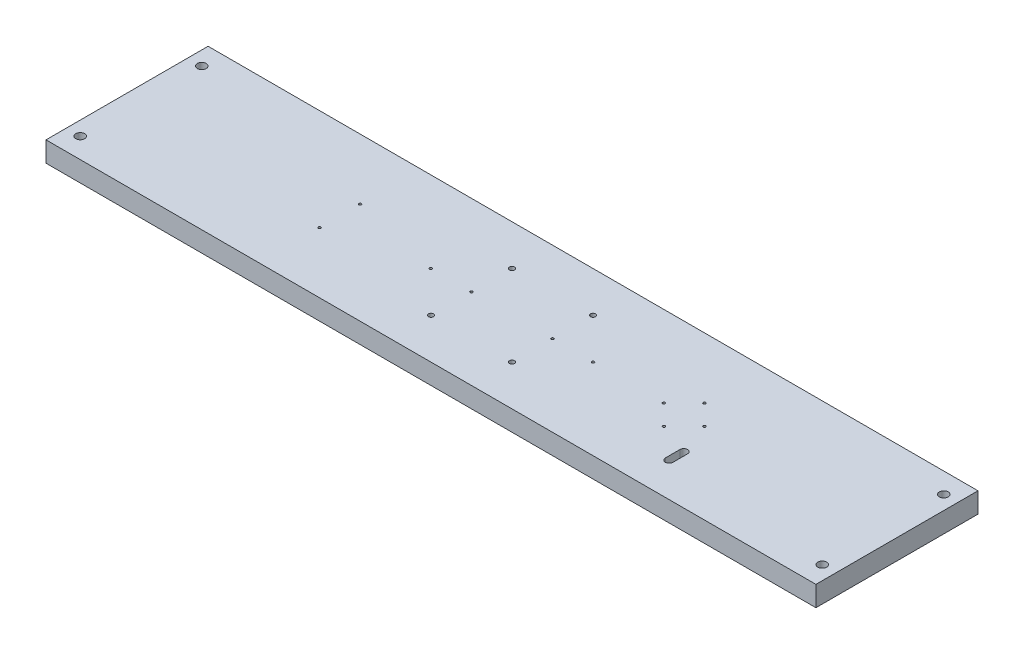
ISO-10303-21;
HEADER;
FILE_DESCRIPTION(('STEP AP214'),'2;1');
FILE_NAME('part.step','',(''),(''),'','','');
FILE_SCHEMA(('AUTOMOTIVE_DESIGN { 1 0 10303 214 1 1 1 1 }'));
ENDSEC;
DATA;
#1=APPLICATION_CONTEXT('core data for automotive mechanical design processes');
#2=APPLICATION_PROTOCOL_DEFINITION('international standard','automotive_design',2000,#1);
#3=PRODUCT_CONTEXT('',#1,'mechanical');
#4=PRODUCT('Part','Part','',(#3));
#5=PRODUCT_RELATED_PRODUCT_CATEGORY('part','',(#4));
#6=PRODUCT_DEFINITION_FORMATION('','',#4);
#7=PRODUCT_DEFINITION_CONTEXT('part definition',#1,'design');
#8=PRODUCT_DEFINITION('design','',#6,#7);
#9=PRODUCT_DEFINITION_SHAPE('','',#8);
#10=(LENGTH_UNIT() NAMED_UNIT(*) SI_UNIT(.MILLI.,.METRE.));
#11=(NAMED_UNIT(*) PLANE_ANGLE_UNIT() SI_UNIT($,.RADIAN.));
#12=(NAMED_UNIT(*) SI_UNIT($,.STERADIAN.) SOLID_ANGLE_UNIT());
#13=UNCERTAINTY_MEASURE_WITH_UNIT(LENGTH_MEASURE(1.E-05),#10,'distance_accuracy_value','');
#14=(GEOMETRIC_REPRESENTATION_CONTEXT(3) GLOBAL_UNCERTAINTY_ASSIGNED_CONTEXT((#13)) GLOBAL_UNIT_ASSIGNED_CONTEXT((#10,
#11,#12)) REPRESENTATION_CONTEXT('',''));
#15=CARTESIAN_POINT('',(0.,0.,0.));
#16=DIRECTION('',(0.,0.,1.));
#17=DIRECTION('',(1.,0.,0.));
#18=AXIS2_PLACEMENT_3D('',#15,#16,#17);
#19=CARTESIAN_POINT('',(241.3,12.7,50.8));
#20=DIRECTION('',(-1.,0.,0.));
#21=DIRECTION('',(0.,0.,1.));
#22=AXIS2_PLACEMENT_3D('',#19,#20,#21);
#23=PLANE('',#22);
#24=DIRECTION('',(0.,0.,-1.));
#25=VECTOR('',#24,1.);
#26=CARTESIAN_POINT('',(241.3,0.,50.8));
#27=LINE('',#26,#25);
#28=CARTESIAN_POINT('',(241.3,0.,50.8));
#29=VERTEX_POINT('',#28);
#30=CARTESIAN_POINT('',(241.3,0.,-50.8));
#31=VERTEX_POINT('',#30);
#32=EDGE_CURVE('E243',#29,#31,#27,.T.);
#33=ORIENTED_EDGE('',*,*,#32,.T.);
#34=DIRECTION('',(0.,-1.,0.));
#35=VECTOR('',#34,1.);
#36=CARTESIAN_POINT('',(241.3,12.7,-50.8));
#37=LINE('',#36,#35);
#38=CARTESIAN_POINT('',(241.3,12.7,-50.8));
#39=VERTEX_POINT('',#38);
#40=EDGE_CURVE('E11',#39,#31,#37,.T.);
#41=ORIENTED_EDGE('',*,*,#40,.F.);
#42=DIRECTION('',(0.,0.,-1.));
#43=VECTOR('',#42,1.);
#44=CARTESIAN_POINT('',(241.3,12.7,50.8));
#45=LINE('',#44,#43);
#46=CARTESIAN_POINT('',(241.3,12.7,50.8));
#47=VERTEX_POINT('',#46);
#48=EDGE_CURVE('E246',#47,#39,#45,.T.);
#49=ORIENTED_EDGE('',*,*,#48,.F.);
#50=DIRECTION('',(0.,-1.,0.));
#51=VECTOR('',#50,1.);
#52=CARTESIAN_POINT('',(241.3,12.7,50.8));
#53=LINE('',#52,#51);
#54=EDGE_CURVE('E256',#47,#29,#53,.T.);
#55=ORIENTED_EDGE('',*,*,#54,.T.);
#56=EDGE_LOOP('',(#33,#41,#49,#55));
#57=FACE_BOUND('',#56,.T.);
#58=ADVANCED_FACE('F37',(#57),#23,.F.);
#59=CARTESIAN_POINT('',(-241.3,12.7,-50.8));
#60=DIRECTION('',(0.,0.,1.));
#61=DIRECTION('',(1.,0.,0.));
#62=AXIS2_PLACEMENT_3D('',#59,#60,#61);
#63=PLANE('',#62);
#64=DIRECTION('',(-1.,0.,0.));
#65=VECTOR('',#64,1.);
#66=CARTESIAN_POINT('',(-241.3,0.,-50.8));
#67=LINE('',#66,#65);
#68=CARTESIAN_POINT('',(-241.3,0.,-50.8));
#69=VERTEX_POINT('',#68);
#70=EDGE_CURVE('E259',#31,#69,#67,.T.);
#71=ORIENTED_EDGE('',*,*,#70,.T.);
#72=DIRECTION('',(0.,-1.,0.));
#73=VECTOR('',#72,1.);
#74=CARTESIAN_POINT('',(-241.3,12.7,-50.8));
#75=LINE('',#74,#73);
#76=CARTESIAN_POINT('',(-241.3,12.7,-50.8));
#77=VERTEX_POINT('',#76);
#78=EDGE_CURVE('E44',#77,#69,#75,.T.);
#79=ORIENTED_EDGE('',*,*,#78,.F.);
#80=DIRECTION('',(-1.,0.,0.));
#81=VECTOR('',#80,1.);
#82=CARTESIAN_POINT('',(-241.3,12.7,-50.8));
#83=LINE('',#82,#81);
#84=EDGE_CURVE('E249',#39,#77,#83,.T.);
#85=ORIENTED_EDGE('',*,*,#84,.F.);
#86=ORIENTED_EDGE('',*,*,#40,.T.);
#87=EDGE_LOOP('',(#71,#79,#85,#86));
#88=FACE_BOUND('',#87,.T.);
#89=ADVANCED_FACE('F288',(#88),#63,.F.);
#90=CARTESIAN_POINT('',(-241.3,12.7,50.8));
#91=DIRECTION('',(1.,0.,0.));
#92=DIRECTION('',(0.,0.,-1.));
#93=AXIS2_PLACEMENT_3D('',#90,#91,#92);
#94=PLANE('',#93);
#95=DIRECTION('',(0.,0.,1.));
#96=VECTOR('',#95,1.);
#97=CARTESIAN_POINT('',(-241.3,0.,50.8));
#98=LINE('',#97,#96);
#99=CARTESIAN_POINT('',(-241.3,0.,50.8));
#100=VERTEX_POINT('',#99);
#101=EDGE_CURVE('E261',#69,#100,#98,.T.);
#102=ORIENTED_EDGE('',*,*,#101,.T.);
#103=DIRECTION('',(0.,-1.,0.));
#104=VECTOR('',#103,1.);
#105=CARTESIAN_POINT('',(-241.3,12.7,50.8));
#106=LINE('',#105,#104);
#107=CARTESIAN_POINT('',(-241.3,12.7,50.8));
#108=VERTEX_POINT('',#107);
#109=EDGE_CURVE('E266',#108,#100,#106,.T.);
#110=ORIENTED_EDGE('',*,*,#109,.F.);
#111=DIRECTION('',(0.,0.,1.));
#112=VECTOR('',#111,1.);
#113=CARTESIAN_POINT('',(-241.3,12.7,50.8));
#114=LINE('',#113,#112);
#115=EDGE_CURVE('E252',#77,#108,#114,.T.);
#116=ORIENTED_EDGE('',*,*,#115,.F.);
#117=ORIENTED_EDGE('',*,*,#78,.T.);
#118=EDGE_LOOP('',(#102,#110,#116,#117));
#119=FACE_BOUND('',#118,.T.);
#120=ADVANCED_FACE('F273',(#119),#94,.F.);
#121=CARTESIAN_POINT('',(-241.3,12.7,50.8));
#122=DIRECTION('',(0.,0.,-1.));
#123=DIRECTION('',(-1.,0.,0.));
#124=AXIS2_PLACEMENT_3D('',#121,#122,#123);
#125=PLANE('',#124);
#126=DIRECTION('',(1.,0.,0.));
#127=VECTOR('',#126,1.);
#128=CARTESIAN_POINT('',(-241.3,0.,50.8));
#129=LINE('',#128,#127);
#130=EDGE_CURVE('E250',#100,#29,#129,.T.);
#131=ORIENTED_EDGE('',*,*,#130,.T.);
#132=ORIENTED_EDGE('',*,*,#54,.F.);
#133=DIRECTION('',(1.,0.,0.));
#134=VECTOR('',#133,1.);
#135=CARTESIAN_POINT('',(-241.3,12.7,50.8));
#136=LINE('',#135,#134);
#137=EDGE_CURVE('E254',#108,#47,#136,.T.);
#138=ORIENTED_EDGE('',*,*,#137,.F.);
#139=ORIENTED_EDGE('',*,*,#109,.T.);
#140=EDGE_LOOP('',(#131,#132,#138,#139));
#141=FACE_BOUND('',#140,.T.);
#142=ADVANCED_FACE('F281',(#141),#125,.F.);
#143=CARTESIAN_POINT('',(0.,12.7,0.));
#144=DIRECTION('',(0.,-1.,0.));
#145=DIRECTION('',(0.,0.,-1.));
#146=AXIS2_PLACEMENT_3D('',#143,#144,#145);
#147=PLANE('',#146);
#148=DIRECTION('',(0.,0.,1.));
#149=VECTOR('',#148,1.);
#150=CARTESIAN_POINT('',(125.489928348176,12.7,20.1549));
#151=LINE('',#150,#149);
#152=CARTESIAN_POINT('',(125.489928348176,12.7,20.1549));
#153=VERTEX_POINT('',#152);
#154=CARTESIAN_POINT('',(125.489928348176,12.7,29.3751));
#155=VERTEX_POINT('',#154);
#156=EDGE_CURVE('E128',#153,#155,#151,.T.);
#157=ORIENTED_EDGE('',*,*,#156,.F.);
#158=CARTESIAN_POINT('',(127.864828348176,12.7,20.1549));
#159=DIRECTION('',(0.,1.,0.));
#160=DIRECTION('',(0.,0.,-1.));
#161=AXIS2_PLACEMENT_3D('',#158,#159,#160);
#162=CIRCLE('',#161,2.37490000000001);
#163=CARTESIAN_POINT('',(130.239728348176,12.7,20.1549));
#164=VERTEX_POINT('',#163);
#165=EDGE_CURVE('E51',#164,#153,#162,.T.);
#166=ORIENTED_EDGE('',*,*,#165,.F.);
#167=DIRECTION('',(0.,0.,-1.));
#168=VECTOR('',#167,1.);
#169=CARTESIAN_POINT('',(130.239728348176,12.7,20.1549));
#170=LINE('',#169,#168);
#171=CARTESIAN_POINT('',(130.239728348176,12.7,29.3751));
#172=VERTEX_POINT('',#171);
#173=EDGE_CURVE('E119',#172,#164,#170,.T.);
#174=ORIENTED_EDGE('',*,*,#173,.F.);
#175=CARTESIAN_POINT('',(127.864828348176,12.7,29.3751));
#176=DIRECTION('',(0.,1.,0.));
#177=DIRECTION('',(0.,0.,-1.));
#178=AXIS2_PLACEMENT_3D('',#175,#176,#177);
#179=CIRCLE('',#178,2.37489999999999);
#180=EDGE_CURVE('E122',#155,#172,#179,.T.);
#181=ORIENTED_EDGE('',*,*,#180,.F.);
#182=EDGE_LOOP('',(#157,#166,#174,#181));
#183=FACE_BOUND('',#182,.T.);
#184=CARTESIAN_POINT('',(95.25,12.7,0.));
#185=DIRECTION('',(0.,1.,0.));
#186=DIRECTION('',(0.,0.,1.));
#187=AXIS2_PLACEMENT_3D('',#184,#185,#186);
#188=CIRCLE('',#187,0.793749999999993);
#189=CARTESIAN_POINT('',(95.25,12.7,0.793749999999993));
#190=VERTEX_POINT('',#189);
#191=EDGE_CURVE('E142',#190,#190,#188,.T.);
#192=ORIENTED_EDGE('',*,*,#191,.F.);
#193=EDGE_LOOP('',(#192));
#194=FACE_BOUND('',#193,.T.);
#195=CARTESIAN_POINT('',(120.65,12.7,0.));
#196=DIRECTION('',(0.,1.,0.));
#197=DIRECTION('',(0.,0.,1.));
#198=AXIS2_PLACEMENT_3D('',#195,#196,#197);
#199=CIRCLE('',#198,0.793749999999993);
#200=CARTESIAN_POINT('',(120.65,12.7,0.793749999999993));
#201=VERTEX_POINT('',#200);
#202=EDGE_CURVE('E145',#201,#201,#199,.T.);
#203=ORIENTED_EDGE('',*,*,#202,.F.);
#204=EDGE_LOOP('',(#203));
#205=FACE_BOUND('',#204,.T.);
#206=CARTESIAN_POINT('',(-107.95,12.7,-12.7));
#207=DIRECTION('',(0.,1.,0.));
#208=DIRECTION('',(0.,0.,1.));
#209=AXIS2_PLACEMENT_3D('',#206,#207,#208);
#210=CIRCLE('',#209,0.793749999999993);
#211=CARTESIAN_POINT('',(-107.95,12.7,-11.90625));
#212=VERTEX_POINT('',#211);
#213=EDGE_CURVE('E175',#212,#212,#210,.T.);
#214=ORIENTED_EDGE('',*,*,#213,.F.);
#215=EDGE_LOOP('',(#214));
#216=FACE_BOUND('',#215,.T.);
#217=CARTESIAN_POINT('',(50.8,12.7,0.));
#218=DIRECTION('',(0.,1.,0.));
#219=DIRECTION('',(0.,0.,1.));
#220=AXIS2_PLACEMENT_3D('',#217,#218,#219);
#221=CIRCLE('',#220,0.79375);
#222=CARTESIAN_POINT('',(50.8,12.7,0.79375));
#223=VERTEX_POINT('',#222);
#224=EDGE_CURVE('E168',#223,#223,#221,.T.);
#225=ORIENTED_EDGE('',*,*,#224,.F.);
#226=EDGE_LOOP('',(#225));
#227=FACE_BOUND('',#226,.T.);
#228=CARTESIAN_POINT('',(-50.8,12.7,0.));
#229=DIRECTION('',(0.,1.,0.));
#230=DIRECTION('',(0.,0.,1.));
#231=AXIS2_PLACEMENT_3D('',#228,#229,#230);
#232=CIRCLE('',#231,0.79375);
#233=CARTESIAN_POINT('',(-50.8,12.7,0.79375));
#234=VERTEX_POINT('',#233);
#235=EDGE_CURVE('E187',#234,#234,#232,.T.);
#236=ORIENTED_EDGE('',*,*,#235,.F.);
#237=EDGE_LOOP('',(#236));
#238=FACE_BOUND('',#237,.T.);
#239=CARTESIAN_POINT('',(25.4,12.7,0.));
#240=DIRECTION('',(0.,1.,0.));
#241=DIRECTION('',(0.,0.,1.));
#242=AXIS2_PLACEMENT_3D('',#239,#240,#241);
#243=CIRCLE('',#242,0.793749999999999);
#244=CARTESIAN_POINT('',(25.4,12.7,0.793749999999999));
#245=VERTEX_POINT('',#244);
#246=EDGE_CURVE('E180',#245,#245,#243,.T.);
#247=ORIENTED_EDGE('',*,*,#246,.F.);
#248=EDGE_LOOP('',(#247));
#249=FACE_BOUND('',#248,.T.);
#250=CARTESIAN_POINT('',(-107.95,12.7,12.7));
#251=DIRECTION('',(0.,1.,0.));
#252=DIRECTION('',(0.,0.,1.));
#253=AXIS2_PLACEMENT_3D('',#250,#251,#252);
#254=CIRCLE('',#253,0.793749999999993);
#255=CARTESIAN_POINT('',(-107.95,12.7,13.49375));
#256=VERTEX_POINT('',#255);
#257=EDGE_CURVE('E150',#256,#256,#254,.T.);
#258=ORIENTED_EDGE('',*,*,#257,.F.);
#259=EDGE_LOOP('',(#258));
#260=FACE_BOUND('',#259,.T.);
#261=CARTESIAN_POINT('',(107.95,12.7,12.7));
#262=DIRECTION('',(0.,1.,0.));
#263=DIRECTION('',(0.,0.,1.));
#264=AXIS2_PLACEMENT_3D('',#261,#262,#263);
#265=CIRCLE('',#264,0.793749999999993);
#266=CARTESIAN_POINT('',(107.95,12.7,13.49375));
#267=VERTEX_POINT('',#266);
#268=EDGE_CURVE('E157',#267,#267,#265,.T.);
#269=ORIENTED_EDGE('',*,*,#268,.F.);
#270=EDGE_LOOP('',(#269));
#271=FACE_BOUND('',#270,.T.);
#272=CARTESIAN_POINT('',(107.95,12.7,-12.7));
#273=DIRECTION('',(0.,1.,0.));
#274=DIRECTION('',(0.,0.,1.));
#275=AXIS2_PLACEMENT_3D('',#272,#273,#274);
#276=CIRCLE('',#275,0.793749999999993);
#277=CARTESIAN_POINT('',(107.95,12.7,-11.90625));
#278=VERTEX_POINT('',#277);
#279=EDGE_CURVE('E163',#278,#278,#276,.T.);
#280=ORIENTED_EDGE('',*,*,#279,.F.);
#281=EDGE_LOOP('',(#280));
#282=FACE_BOUND('',#281,.T.);
#283=CARTESIAN_POINT('',(-25.4,12.7,0.));
#284=DIRECTION('',(0.,1.,0.));
#285=DIRECTION('',(0.,0.,1.));
#286=AXIS2_PLACEMENT_3D('',#283,#284,#285);
#287=CIRCLE('',#286,0.793749999999999);
#288=CARTESIAN_POINT('',(-25.4,12.7,0.793749999999999));
#289=VERTEX_POINT('',#288);
#290=EDGE_CURVE('E183',#289,#289,#287,.T.);
#291=ORIENTED_EDGE('',*,*,#290,.F.);
#292=EDGE_LOOP('',(#291));
#293=FACE_BOUND('',#292,.T.);
#294=CARTESIAN_POINT('',(-25.4,12.7,25.4));
#295=DIRECTION('',(0.,1.,0.));
#296=DIRECTION('',(0.,0.,1.));
#297=AXIS2_PLACEMENT_3D('',#294,#295,#296);
#298=CIRCLE('',#297,1.5875);
#299=CARTESIAN_POINT('',(-25.4,12.7,26.9875));
#300=VERTEX_POINT('',#299);
#301=EDGE_CURVE('E211',#300,#300,#298,.T.);
#302=ORIENTED_EDGE('',*,*,#301,.F.);
#303=EDGE_LOOP('',(#302));
#304=FACE_BOUND('',#303,.T.);
#305=CARTESIAN_POINT('',(25.4,12.7,25.4));
#306=DIRECTION('',(0.,1.,0.));
#307=DIRECTION('',(0.,0.,1.));
#308=AXIS2_PLACEMENT_3D('',#305,#306,#307);
#309=CIRCLE('',#308,1.5875);
#310=CARTESIAN_POINT('',(25.4,12.7,26.9875));
#311=VERTEX_POINT('',#310);
#312=EDGE_CURVE('E205',#311,#311,#309,.T.);
#313=ORIENTED_EDGE('',*,*,#312,.F.);
#314=EDGE_LOOP('',(#313));
#315=FACE_BOUND('',#314,.T.);
#316=CARTESIAN_POINT('',(25.4,12.7,-25.4));
#317=DIRECTION('',(0.,1.,0.));
#318=DIRECTION('',(0.,0.,1.));
#319=AXIS2_PLACEMENT_3D('',#316,#317,#318);
#320=CIRCLE('',#319,1.5875);
#321=CARTESIAN_POINT('',(25.4,12.7,-23.8125));
#322=VERTEX_POINT('',#321);
#323=EDGE_CURVE('E198',#322,#322,#320,.T.);
#324=ORIENTED_EDGE('',*,*,#323,.F.);
#325=EDGE_LOOP('',(#324));
#326=FACE_BOUND('',#325,.T.);
#327=CARTESIAN_POINT('',(-25.4,12.7,-25.4));
#328=DIRECTION('',(0.,1.,0.));
#329=DIRECTION('',(0.,0.,1.));
#330=AXIS2_PLACEMENT_3D('',#327,#328,#329);
#331=CIRCLE('',#330,1.5875);
#332=CARTESIAN_POINT('',(-25.4,12.7,-23.8125));
#333=VERTEX_POINT('',#332);
#334=EDGE_CURVE('E201',#333,#333,#331,.T.);
#335=ORIENTED_EDGE('',*,*,#334,.F.);
#336=EDGE_LOOP('',(#335));
#337=FACE_BOUND('',#336,.T.);
#338=CARTESIAN_POINT('',(-232.5624,12.7,38.1));
#339=DIRECTION('',(0.,1.,0.));
#340=DIRECTION('',(0.,0.,1.));
#341=AXIS2_PLACEMENT_3D('',#338,#339,#340);
#342=CIRCLE('',#341,2.78129999999998);
#343=CARTESIAN_POINT('',(-232.5624,12.7,40.8813));
#344=VERTEX_POINT('',#343);
#345=EDGE_CURVE('E228',#344,#344,#342,.T.);
#346=ORIENTED_EDGE('',*,*,#345,.F.);
#347=EDGE_LOOP('',(#346));
#348=FACE_BOUND('',#347,.T.);
#349=CARTESIAN_POINT('',(232.5624,12.7,-38.1000000000001));
#350=DIRECTION('',(0.,1.,0.));
#351=DIRECTION('',(0.,0.,1.));
#352=AXIS2_PLACEMENT_3D('',#349,#350,#351);
#353=CIRCLE('',#352,2.78129999999998);
#354=CARTESIAN_POINT('',(232.5624,12.7,-35.3187000000001));
#355=VERTEX_POINT('',#354);
#356=EDGE_CURVE('E235',#355,#355,#353,.T.);
#357=ORIENTED_EDGE('',*,*,#356,.F.);
#358=EDGE_LOOP('',(#357));
#359=FACE_BOUND('',#358,.T.);
#360=CARTESIAN_POINT('',(232.5624,12.7,38.1));
#361=DIRECTION('',(0.,1.,0.));
#362=DIRECTION('',(0.,0.,1.));
#363=AXIS2_PLACEMENT_3D('',#360,#361,#362);
#364=CIRCLE('',#363,2.78129999999998);
#365=CARTESIAN_POINT('',(232.5624,12.7,40.8812999999999));
#366=VERTEX_POINT('',#365);
#367=EDGE_CURVE('E222',#366,#366,#364,.T.);
#368=ORIENTED_EDGE('',*,*,#367,.F.);
#369=EDGE_LOOP('',(#368));
#370=FACE_BOUND('',#369,.T.);
#371=CARTESIAN_POINT('',(-232.5624,12.7,-38.1));
#372=DIRECTION('',(0.,1.,0.));
#373=DIRECTION('',(0.,0.,1.));
#374=AXIS2_PLACEMENT_3D('',#371,#372,#373);
#375=CIRCLE('',#374,2.78129999999998);
#376=CARTESIAN_POINT('',(-232.5624,12.7,-35.3187));
#377=VERTEX_POINT('',#376);
#378=EDGE_CURVE('E231',#377,#377,#375,.T.);
#379=ORIENTED_EDGE('',*,*,#378,.F.);
#380=EDGE_LOOP('',(#379));
#381=FACE_BOUND('',#380,.T.);
#382=ORIENTED_EDGE('',*,*,#48,.T.);
#383=ORIENTED_EDGE('',*,*,#84,.T.);
#384=ORIENTED_EDGE('',*,*,#115,.T.);
#385=ORIENTED_EDGE('',*,*,#137,.T.);
#386=EDGE_LOOP('',(#382,#383,#384,#385));
#387=FACE_BOUND('',#386,.T.);
#388=ADVANCED_FACE('F287',(#183,#194,#205,#216,#227,#238,#249,#260,#271,#282,#293,#304,#315,
#326,#337,#348,#359,#370,#381,#387),#147,.F.);
#389=CARTESIAN_POINT('',(0.,0.,0.));
#390=DIRECTION('',(0.,-1.,0.));
#391=DIRECTION('',(0.,0.,-1.));
#392=AXIS2_PLACEMENT_3D('',#389,#390,#391);
#393=PLANE('',#392);
#394=CARTESIAN_POINT('',(127.864828348176,0.,20.1549));
#395=DIRECTION('',(0.,1.,0.));
#396=DIRECTION('',(0.,0.,-1.));
#397=AXIS2_PLACEMENT_3D('',#394,#395,#396);
#398=CIRCLE('',#397,2.37490000000001);
#399=CARTESIAN_POINT('',(130.239728348176,0.,20.1549));
#400=VERTEX_POINT('',#399);
#401=CARTESIAN_POINT('',(125.489928348176,0.,20.1549));
#402=VERTEX_POINT('',#401);
#403=EDGE_CURVE('E103',#400,#402,#398,.T.);
#404=ORIENTED_EDGE('',*,*,#403,.T.);
#405=DIRECTION('',(0.,0.,1.));
#406=VECTOR('',#405,1.);
#407=CARTESIAN_POINT('',(125.489928348176,0.,20.1549));
#408=LINE('',#407,#406);
#409=CARTESIAN_POINT('',(125.489928348176,0.,29.3751));
#410=VERTEX_POINT('',#409);
#411=EDGE_CURVE('E112',#402,#410,#408,.T.);
#412=ORIENTED_EDGE('',*,*,#411,.T.);
#413=CARTESIAN_POINT('',(127.864828348176,0.,29.3751));
#414=DIRECTION('',(0.,1.,0.));
#415=DIRECTION('',(0.,0.,-1.));
#416=AXIS2_PLACEMENT_3D('',#413,#414,#415);
#417=CIRCLE('',#416,2.37489999999999);
#418=CARTESIAN_POINT('',(130.239728348176,0.,29.3751));
#419=VERTEX_POINT('',#418);
#420=EDGE_CURVE('E59',#410,#419,#417,.T.);
#421=ORIENTED_EDGE('',*,*,#420,.T.);
#422=DIRECTION('',(0.,0.,-1.));
#423=VECTOR('',#422,1.);
#424=CARTESIAN_POINT('',(130.239728348176,0.,20.1549));
#425=LINE('',#424,#423);
#426=EDGE_CURVE('E109',#419,#400,#425,.T.);
#427=ORIENTED_EDGE('',*,*,#426,.T.);
#428=EDGE_LOOP('',(#404,#412,#421,#427));
#429=FACE_BOUND('',#428,.T.);
#430=CARTESIAN_POINT('',(95.25,0.,0.));
#431=DIRECTION('',(0.,1.,0.));
#432=DIRECTION('',(0.,0.,1.));
#433=AXIS2_PLACEMENT_3D('',#430,#431,#432);
#434=CIRCLE('',#433,0.793749999999993);
#435=CARTESIAN_POINT('',(95.25,0.,0.793749999999993));
#436=VERTEX_POINT('',#435);
#437=EDGE_CURVE('E138',#436,#436,#434,.T.);
#438=ORIENTED_EDGE('',*,*,#437,.T.);
#439=EDGE_LOOP('',(#438));
#440=FACE_BOUND('',#439,.T.);
#441=CARTESIAN_POINT('',(120.65,0.,0.));
#442=DIRECTION('',(0.,1.,0.));
#443=DIRECTION('',(0.,0.,1.));
#444=AXIS2_PLACEMENT_3D('',#441,#442,#443);
#445=CIRCLE('',#444,0.793749999999993);
#446=CARTESIAN_POINT('',(120.65,0.,0.793749999999993));
#447=VERTEX_POINT('',#446);
#448=EDGE_CURVE('E134',#447,#447,#445,.T.);
#449=ORIENTED_EDGE('',*,*,#448,.T.);
#450=EDGE_LOOP('',(#449));
#451=FACE_BOUND('',#450,.T.);
#452=CARTESIAN_POINT('',(-107.95,0.,-12.7));
#453=DIRECTION('',(0.,1.,0.));
#454=DIRECTION('',(0.,0.,1.));
#455=AXIS2_PLACEMENT_3D('',#452,#453,#454);
#456=CIRCLE('',#455,0.793749999999993);
#457=CARTESIAN_POINT('',(-107.95,0.,-11.90625));
#458=VERTEX_POINT('',#457);
#459=EDGE_CURVE('E153',#458,#458,#456,.T.);
#460=ORIENTED_EDGE('',*,*,#459,.T.);
#461=EDGE_LOOP('',(#460));
#462=FACE_BOUND('',#461,.T.);
#463=CARTESIAN_POINT('',(50.8,0.,0.));
#464=DIRECTION('',(0.,1.,0.));
#465=DIRECTION('',(0.,0.,1.));
#466=AXIS2_PLACEMENT_3D('',#463,#464,#465);
#467=CIRCLE('',#466,0.79375);
#468=CARTESIAN_POINT('',(50.8,0.,0.79375));
#469=VERTEX_POINT('',#468);
#470=EDGE_CURVE('E172',#469,#469,#467,.T.);
#471=ORIENTED_EDGE('',*,*,#470,.T.);
#472=EDGE_LOOP('',(#471));
#473=FACE_BOUND('',#472,.T.);
#474=CARTESIAN_POINT('',(-50.8,0.,0.));
#475=DIRECTION('',(0.,1.,0.));
#476=DIRECTION('',(0.,0.,1.));
#477=AXIS2_PLACEMENT_3D('',#474,#475,#476);
#478=CIRCLE('',#477,0.79375);
#479=CARTESIAN_POINT('',(-50.8,0.,0.79375));
#480=VERTEX_POINT('',#479);
#481=EDGE_CURVE('E171',#480,#480,#478,.T.);
#482=ORIENTED_EDGE('',*,*,#481,.T.);
#483=EDGE_LOOP('',(#482));
#484=FACE_BOUND('',#483,.T.);
#485=CARTESIAN_POINT('',(25.4,0.,0.));
#486=DIRECTION('',(0.,1.,0.));
#487=DIRECTION('',(0.,0.,1.));
#488=AXIS2_PLACEMENT_3D('',#485,#486,#487);
#489=CIRCLE('',#488,0.793749999999999);
#490=CARTESIAN_POINT('',(25.4,0.,0.793749999999999));
#491=VERTEX_POINT('',#490);
#492=EDGE_CURVE('E184',#491,#491,#489,.T.);
#493=ORIENTED_EDGE('',*,*,#492,.T.);
#494=EDGE_LOOP('',(#493));
#495=FACE_BOUND('',#494,.T.);
#496=CARTESIAN_POINT('',(-107.95,0.,12.7));
#497=DIRECTION('',(0.,1.,0.));
#498=DIRECTION('',(0.,0.,1.));
#499=AXIS2_PLACEMENT_3D('',#496,#497,#498);
#500=CIRCLE('',#499,0.793749999999993);
#501=CARTESIAN_POINT('',(-107.95,0.,13.49375));
#502=VERTEX_POINT('',#501);
#503=EDGE_CURVE('E154',#502,#502,#500,.T.);
#504=ORIENTED_EDGE('',*,*,#503,.T.);
#505=EDGE_LOOP('',(#504));
#506=FACE_BOUND('',#505,.T.);
#507=CARTESIAN_POINT('',(107.95,0.,12.7));
#508=DIRECTION('',(0.,1.,0.));
#509=DIRECTION('',(0.,0.,1.));
#510=AXIS2_PLACEMENT_3D('',#507,#508,#509);
#511=CIRCLE('',#510,0.793749999999993);
#512=CARTESIAN_POINT('',(107.95,0.,13.49375));
#513=VERTEX_POINT('',#512);
#514=EDGE_CURVE('E160',#513,#513,#511,.T.);
#515=ORIENTED_EDGE('',*,*,#514,.T.);
#516=EDGE_LOOP('',(#515));
#517=FACE_BOUND('',#516,.T.);
#518=CARTESIAN_POINT('',(107.95,0.,-12.7));
#519=DIRECTION('',(0.,1.,0.));
#520=DIRECTION('',(0.,0.,1.));
#521=AXIS2_PLACEMENT_3D('',#518,#519,#520);
#522=CIRCLE('',#521,0.793749999999993);
#523=CARTESIAN_POINT('',(107.95,0.,-11.90625));
#524=VERTEX_POINT('',#523);
#525=EDGE_CURVE('E141',#524,#524,#522,.T.);
#526=ORIENTED_EDGE('',*,*,#525,.T.);
#527=EDGE_LOOP('',(#526));
#528=FACE_BOUND('',#527,.T.);
#529=CARTESIAN_POINT('',(-25.4,0.,0.));
#530=DIRECTION('',(0.,1.,0.));
#531=DIRECTION('',(0.,0.,1.));
#532=AXIS2_PLACEMENT_3D('',#529,#530,#531);
#533=CIRCLE('',#532,0.793749999999999);
#534=CARTESIAN_POINT('',(-25.4,0.,0.793749999999999));
#535=VERTEX_POINT('',#534);
#536=EDGE_CURVE('E192',#535,#535,#533,.T.);
#537=ORIENTED_EDGE('',*,*,#536,.T.);
#538=EDGE_LOOP('',(#537));
#539=FACE_BOUND('',#538,.T.);
#540=CARTESIAN_POINT('',(-25.4,0.,25.4));
#541=DIRECTION('',(0.,1.,0.));
#542=DIRECTION('',(0.,0.,1.));
#543=AXIS2_PLACEMENT_3D('',#540,#541,#542);
#544=CIRCLE('',#543,1.5875);
#545=CARTESIAN_POINT('',(-25.4,0.,26.9875));
#546=VERTEX_POINT('',#545);
#547=EDGE_CURVE('E195',#546,#546,#544,.T.);
#548=ORIENTED_EDGE('',*,*,#547,.T.);
#549=EDGE_LOOP('',(#548));
#550=FACE_BOUND('',#549,.T.);
#551=CARTESIAN_POINT('',(25.4,0.,25.4));
#552=DIRECTION('',(0.,1.,0.));
#553=DIRECTION('',(0.,0.,1.));
#554=AXIS2_PLACEMENT_3D('',#551,#552,#553);
#555=CIRCLE('',#554,1.5875);
#556=CARTESIAN_POINT('',(25.4,0.,26.9875));
#557=VERTEX_POINT('',#556);
#558=EDGE_CURVE('E208',#557,#557,#555,.T.);
#559=ORIENTED_EDGE('',*,*,#558,.T.);
#560=EDGE_LOOP('',(#559));
#561=FACE_BOUND('',#560,.T.);
#562=CARTESIAN_POINT('',(25.4,0.,-25.4));
#563=DIRECTION('',(0.,1.,0.));
#564=DIRECTION('',(0.,0.,1.));
#565=AXIS2_PLACEMENT_3D('',#562,#563,#564);
#566=CIRCLE('',#565,1.5875);
#567=CARTESIAN_POINT('',(25.4,0.,-23.8125));
#568=VERTEX_POINT('',#567);
#569=EDGE_CURVE('E202',#568,#568,#566,.T.);
#570=ORIENTED_EDGE('',*,*,#569,.T.);
#571=EDGE_LOOP('',(#570));
#572=FACE_BOUND('',#571,.T.);
#573=CARTESIAN_POINT('',(-25.4,0.,-25.4));
#574=DIRECTION('',(0.,1.,0.));
#575=DIRECTION('',(0.,0.,1.));
#576=AXIS2_PLACEMENT_3D('',#573,#574,#575);
#577=CIRCLE('',#576,1.5875);
#578=CARTESIAN_POINT('',(-25.4,0.,-23.8125));
#579=VERTEX_POINT('',#578);
#580=EDGE_CURVE('E216',#579,#579,#577,.T.);
#581=ORIENTED_EDGE('',*,*,#580,.T.);
#582=EDGE_LOOP('',(#581));
#583=FACE_BOUND('',#582,.T.);
#584=CARTESIAN_POINT('',(-232.5624,0.,38.1));
#585=DIRECTION('',(0.,1.,0.));
#586=DIRECTION('',(0.,0.,1.));
#587=AXIS2_PLACEMENT_3D('',#584,#585,#586);
#588=CIRCLE('',#587,2.78129999999998);
#589=CARTESIAN_POINT('',(-232.5624,0.,40.8813));
#590=VERTEX_POINT('',#589);
#591=EDGE_CURVE('E232',#590,#590,#588,.T.);
#592=ORIENTED_EDGE('',*,*,#591,.T.);
#593=EDGE_LOOP('',(#592));
#594=FACE_BOUND('',#593,.T.);
#595=CARTESIAN_POINT('',(232.5624,0.,-38.1000000000001));
#596=DIRECTION('',(0.,1.,0.));
#597=DIRECTION('',(0.,0.,1.));
#598=AXIS2_PLACEMENT_3D('',#595,#596,#597);
#599=CIRCLE('',#598,2.78129999999998);
#600=CARTESIAN_POINT('',(232.5624,0.,-35.3187000000001));
#601=VERTEX_POINT('',#600);
#602=EDGE_CURVE('E225',#601,#601,#599,.T.);
#603=ORIENTED_EDGE('',*,*,#602,.T.);
#604=EDGE_LOOP('',(#603));
#605=FACE_BOUND('',#604,.T.);
#606=CARTESIAN_POINT('',(232.5624,0.,38.1));
#607=DIRECTION('',(0.,1.,0.));
#608=DIRECTION('',(0.,0.,1.));
#609=AXIS2_PLACEMENT_3D('',#606,#607,#608);
#610=CIRCLE('',#609,2.78129999999998);
#611=CARTESIAN_POINT('',(232.5624,0.,40.8812999999999));
#612=VERTEX_POINT('',#611);
#613=EDGE_CURVE('E219',#612,#612,#610,.T.);
#614=ORIENTED_EDGE('',*,*,#613,.T.);
#615=EDGE_LOOP('',(#614));
#616=FACE_BOUND('',#615,.T.);
#617=CARTESIAN_POINT('',(-232.5624,0.,-38.1));
#618=DIRECTION('',(0.,1.,0.));
#619=DIRECTION('',(0.,0.,1.));
#620=AXIS2_PLACEMENT_3D('',#617,#618,#619);
#621=CIRCLE('',#620,2.78129999999998);
#622=CARTESIAN_POINT('',(-232.5624,0.,-35.3187));
#623=VERTEX_POINT('',#622);
#624=EDGE_CURVE('E240',#623,#623,#621,.T.);
#625=ORIENTED_EDGE('',*,*,#624,.T.);
#626=EDGE_LOOP('',(#625));
#627=FACE_BOUND('',#626,.T.);
#628=ORIENTED_EDGE('',*,*,#32,.F.);
#629=ORIENTED_EDGE('',*,*,#130,.F.);
#630=ORIENTED_EDGE('',*,*,#101,.F.);
#631=ORIENTED_EDGE('',*,*,#70,.F.);
#632=EDGE_LOOP('',(#628,#629,#630,#631));
#633=FACE_BOUND('',#632,.T.);
#634=ADVANCED_FACE('F116',(#429,#440,#451,#462,#473,#484,#495,#506,#517,#528,#539,#550,#561,
#572,#583,#594,#605,#616,#627,#633),#393,.T.);
#635=CARTESIAN_POINT('',(-232.5624,0.,-38.1));
#636=DIRECTION('',(0.,1.,0.));
#637=DIRECTION('',(0.,0.,1.));
#638=AXIS2_PLACEMENT_3D('',#635,#636,#637);
#639=CYLINDRICAL_SURFACE('',#638,2.78129999999998);
#640=ORIENTED_EDGE('',*,*,#624,.F.);
#641=EDGE_LOOP('',(#640));
#642=FACE_BOUND('',#641,.T.);
#643=ORIENTED_EDGE('',*,*,#378,.T.);
#644=EDGE_LOOP('',(#643));
#645=FACE_BOUND('',#644,.T.);
#646=ADVANCED_FACE('F300',(#642,#645),#639,.F.);
#647=CARTESIAN_POINT('',(232.5624,0.,38.1));
#648=DIRECTION('',(0.,1.,0.));
#649=DIRECTION('',(0.,0.,1.));
#650=AXIS2_PLACEMENT_3D('',#647,#648,#649);
#651=CYLINDRICAL_SURFACE('',#650,2.78129999999998);
#652=ORIENTED_EDGE('',*,*,#613,.F.);
#653=EDGE_LOOP('',(#652));
#654=FACE_BOUND('',#653,.T.);
#655=ORIENTED_EDGE('',*,*,#367,.T.);
#656=EDGE_LOOP('',(#655));
#657=FACE_BOUND('',#656,.T.);
#658=ADVANCED_FACE('F306',(#654,#657),#651,.F.);
#659=CARTESIAN_POINT('',(232.5624,0.,-38.1000000000001));
#660=DIRECTION('',(0.,1.,0.));
#661=DIRECTION('',(0.,0.,1.));
#662=AXIS2_PLACEMENT_3D('',#659,#660,#661);
#663=CYLINDRICAL_SURFACE('',#662,2.78129999999998);
#664=ORIENTED_EDGE('',*,*,#602,.F.);
#665=EDGE_LOOP('',(#664));
#666=FACE_BOUND('',#665,.T.);
#667=ORIENTED_EDGE('',*,*,#356,.T.);
#668=EDGE_LOOP('',(#667));
#669=FACE_BOUND('',#668,.T.);
#670=ADVANCED_FACE('F308',(#666,#669),#663,.F.);
#671=CARTESIAN_POINT('',(-232.5624,0.,38.1));
#672=DIRECTION('',(0.,1.,0.));
#673=DIRECTION('',(0.,0.,1.));
#674=AXIS2_PLACEMENT_3D('',#671,#672,#673);
#675=CYLINDRICAL_SURFACE('',#674,2.78129999999998);
#676=ORIENTED_EDGE('',*,*,#591,.F.);
#677=EDGE_LOOP('',(#676));
#678=FACE_BOUND('',#677,.T.);
#679=ORIENTED_EDGE('',*,*,#345,.T.);
#680=EDGE_LOOP('',(#679));
#681=FACE_BOUND('',#680,.T.);
#682=ADVANCED_FACE('F311',(#678,#681),#675,.F.);
#683=CARTESIAN_POINT('',(-25.4,0.,-25.4));
#684=DIRECTION('',(0.,1.,0.));
#685=DIRECTION('',(0.,0.,1.));
#686=AXIS2_PLACEMENT_3D('',#683,#684,#685);
#687=CYLINDRICAL_SURFACE('',#686,1.5875);
#688=ORIENTED_EDGE('',*,*,#580,.F.);
#689=EDGE_LOOP('',(#688));
#690=FACE_BOUND('',#689,.T.);
#691=ORIENTED_EDGE('',*,*,#334,.T.);
#692=EDGE_LOOP('',(#691));
#693=FACE_BOUND('',#692,.T.);
#694=ADVANCED_FACE('F315',(#690,#693),#687,.F.);
#695=CARTESIAN_POINT('',(25.4,0.,-25.4));
#696=DIRECTION('',(0.,1.,0.));
#697=DIRECTION('',(0.,0.,1.));
#698=AXIS2_PLACEMENT_3D('',#695,#696,#697);
#699=CYLINDRICAL_SURFACE('',#698,1.5875);
#700=ORIENTED_EDGE('',*,*,#569,.F.);
#701=EDGE_LOOP('',(#700));
#702=FACE_BOUND('',#701,.T.);
#703=ORIENTED_EDGE('',*,*,#323,.T.);
#704=EDGE_LOOP('',(#703));
#705=FACE_BOUND('',#704,.T.);
#706=ADVANCED_FACE('F322',(#702,#705),#699,.F.);
#707=CARTESIAN_POINT('',(25.4,0.,25.4));
#708=DIRECTION('',(0.,1.,0.));
#709=DIRECTION('',(0.,0.,1.));
#710=AXIS2_PLACEMENT_3D('',#707,#708,#709);
#711=CYLINDRICAL_SURFACE('',#710,1.5875);
#712=ORIENTED_EDGE('',*,*,#558,.F.);
#713=EDGE_LOOP('',(#712));
#714=FACE_BOUND('',#713,.T.);
#715=ORIENTED_EDGE('',*,*,#312,.T.);
#716=EDGE_LOOP('',(#715));
#717=FACE_BOUND('',#716,.T.);
#718=ADVANCED_FACE('F328',(#714,#717),#711,.F.);
#719=CARTESIAN_POINT('',(-25.4,0.,25.4));
#720=DIRECTION('',(0.,1.,0.));
#721=DIRECTION('',(0.,0.,1.));
#722=AXIS2_PLACEMENT_3D('',#719,#720,#721);
#723=CYLINDRICAL_SURFACE('',#722,1.5875);
#724=ORIENTED_EDGE('',*,*,#547,.F.);
#725=EDGE_LOOP('',(#724));
#726=FACE_BOUND('',#725,.T.);
#727=ORIENTED_EDGE('',*,*,#301,.T.);
#728=EDGE_LOOP('',(#727));
#729=FACE_BOUND('',#728,.T.);
#730=ADVANCED_FACE('F324',(#726,#729),#723,.F.);
#731=CARTESIAN_POINT('',(-25.4,0.,0.));
#732=DIRECTION('',(0.,1.,0.));
#733=DIRECTION('',(0.,0.,1.));
#734=AXIS2_PLACEMENT_3D('',#731,#732,#733);
#735=CYLINDRICAL_SURFACE('',#734,0.793749999999999);
#736=ORIENTED_EDGE('',*,*,#536,.F.);
#737=EDGE_LOOP('',(#736));
#738=FACE_BOUND('',#737,.T.);
#739=ORIENTED_EDGE('',*,*,#290,.T.);
#740=EDGE_LOOP('',(#739));
#741=FACE_BOUND('',#740,.T.);
#742=ADVANCED_FACE('F327',(#738,#741),#735,.F.);
#743=CARTESIAN_POINT('',(107.95,0.,-12.7));
#744=DIRECTION('',(0.,1.,0.));
#745=DIRECTION('',(0.,0.,1.));
#746=AXIS2_PLACEMENT_3D('',#743,#744,#745);
#747=CYLINDRICAL_SURFACE('',#746,0.793749999999993);
#748=ORIENTED_EDGE('',*,*,#525,.F.);
#749=EDGE_LOOP('',(#748));
#750=FACE_BOUND('',#749,.T.);
#751=ORIENTED_EDGE('',*,*,#279,.T.);
#752=EDGE_LOOP('',(#751));
#753=FACE_BOUND('',#752,.T.);
#754=ADVANCED_FACE('F338',(#750,#753),#747,.F.);
#755=CARTESIAN_POINT('',(107.95,0.,12.7));
#756=DIRECTION('',(0.,1.,0.));
#757=DIRECTION('',(0.,0.,1.));
#758=AXIS2_PLACEMENT_3D('',#755,#756,#757);
#759=CYLINDRICAL_SURFACE('',#758,0.793749999999993);
#760=ORIENTED_EDGE('',*,*,#514,.F.);
#761=EDGE_LOOP('',(#760));
#762=FACE_BOUND('',#761,.T.);
#763=ORIENTED_EDGE('',*,*,#268,.T.);
#764=EDGE_LOOP('',(#763));
#765=FACE_BOUND('',#764,.T.);
#766=ADVANCED_FACE('F360',(#762,#765),#759,.F.);
#767=CARTESIAN_POINT('',(-107.95,0.,12.7));
#768=DIRECTION('',(0.,1.,0.));
#769=DIRECTION('',(0.,0.,1.));
#770=AXIS2_PLACEMENT_3D('',#767,#768,#769);
#771=CYLINDRICAL_SURFACE('',#770,0.793749999999993);
#772=ORIENTED_EDGE('',*,*,#503,.F.);
#773=EDGE_LOOP('',(#772));
#774=FACE_BOUND('',#773,.T.);
#775=ORIENTED_EDGE('',*,*,#257,.T.);
#776=EDGE_LOOP('',(#775));
#777=FACE_BOUND('',#776,.T.);
#778=ADVANCED_FACE('F348',(#774,#777),#771,.F.);
#779=CARTESIAN_POINT('',(25.4,0.,0.));
#780=DIRECTION('',(0.,1.,0.));
#781=DIRECTION('',(0.,0.,1.));
#782=AXIS2_PLACEMENT_3D('',#779,#780,#781);
#783=CYLINDRICAL_SURFACE('',#782,0.793749999999999);
#784=ORIENTED_EDGE('',*,*,#492,.F.);
#785=EDGE_LOOP('',(#784));
#786=FACE_BOUND('',#785,.T.);
#787=ORIENTED_EDGE('',*,*,#246,.T.);
#788=EDGE_LOOP('',(#787));
#789=FACE_BOUND('',#788,.T.);
#790=ADVANCED_FACE('F344',(#786,#789),#783,.F.);
#791=CARTESIAN_POINT('',(-50.8,0.,0.));
#792=DIRECTION('',(0.,1.,0.));
#793=DIRECTION('',(0.,0.,1.));
#794=AXIS2_PLACEMENT_3D('',#791,#792,#793);
#795=CYLINDRICAL_SURFACE('',#794,0.79375);
#796=ORIENTED_EDGE('',*,*,#481,.F.);
#797=EDGE_LOOP('',(#796));
#798=FACE_BOUND('',#797,.T.);
#799=ORIENTED_EDGE('',*,*,#235,.T.);
#800=EDGE_LOOP('',(#799));
#801=FACE_BOUND('',#800,.T.);
#802=ADVANCED_FACE('F340',(#798,#801),#795,.F.);
#803=CARTESIAN_POINT('',(50.8,0.,0.));
#804=DIRECTION('',(0.,1.,0.));
#805=DIRECTION('',(0.,0.,1.));
#806=AXIS2_PLACEMENT_3D('',#803,#804,#805);
#807=CYLINDRICAL_SURFACE('',#806,0.79375);
#808=ORIENTED_EDGE('',*,*,#470,.F.);
#809=EDGE_LOOP('',(#808));
#810=FACE_BOUND('',#809,.T.);
#811=ORIENTED_EDGE('',*,*,#224,.T.);
#812=EDGE_LOOP('',(#811));
#813=FACE_BOUND('',#812,.T.);
#814=ADVANCED_FACE('F343',(#810,#813),#807,.F.);
#815=CARTESIAN_POINT('',(-107.95,0.,-12.7));
#816=DIRECTION('',(0.,1.,0.));
#817=DIRECTION('',(0.,0.,1.));
#818=AXIS2_PLACEMENT_3D('',#815,#816,#817);
#819=CYLINDRICAL_SURFACE('',#818,0.793749999999993);
#820=ORIENTED_EDGE('',*,*,#459,.F.);
#821=EDGE_LOOP('',(#820));
#822=FACE_BOUND('',#821,.T.);
#823=ORIENTED_EDGE('',*,*,#213,.T.);
#824=EDGE_LOOP('',(#823));
#825=FACE_BOUND('',#824,.T.);
#826=ADVANCED_FACE('F350',(#822,#825),#819,.F.);
#827=CARTESIAN_POINT('',(120.65,0.,0.));
#828=DIRECTION('',(0.,1.,0.));
#829=DIRECTION('',(0.,0.,1.));
#830=AXIS2_PLACEMENT_3D('',#827,#828,#829);
#831=CYLINDRICAL_SURFACE('',#830,0.793749999999993);
#832=ORIENTED_EDGE('',*,*,#448,.F.);
#833=EDGE_LOOP('',(#832));
#834=FACE_BOUND('',#833,.T.);
#835=ORIENTED_EDGE('',*,*,#202,.T.);
#836=EDGE_LOOP('',(#835));
#837=FACE_BOUND('',#836,.T.);
#838=ADVANCED_FACE('F353',(#834,#837),#831,.F.);
#839=CARTESIAN_POINT('',(95.25,0.,0.));
#840=DIRECTION('',(0.,1.,0.));
#841=DIRECTION('',(0.,0.,1.));
#842=AXIS2_PLACEMENT_3D('',#839,#840,#841);
#843=CYLINDRICAL_SURFACE('',#842,0.793749999999993);
#844=ORIENTED_EDGE('',*,*,#437,.F.);
#845=EDGE_LOOP('',(#844));
#846=FACE_BOUND('',#845,.T.);
#847=ORIENTED_EDGE('',*,*,#191,.T.);
#848=EDGE_LOOP('',(#847));
#849=FACE_BOUND('',#848,.T.);
#850=ADVANCED_FACE('F370',(#846,#849),#843,.F.);
#851=CARTESIAN_POINT('',(127.864828348176,0.,20.1549));
#852=DIRECTION('',(0.,1.,0.));
#853=DIRECTION('',(0.,0.,1.));
#854=AXIS2_PLACEMENT_3D('',#851,#852,#853);
#855=CYLINDRICAL_SURFACE('',#854,2.37490000000001);
#856=ORIENTED_EDGE('',*,*,#165,.T.);
#857=DIRECTION('',(0.,1.,0.));
#858=VECTOR('',#857,1.);
#859=CARTESIAN_POINT('',(125.489928348176,0.,20.1549));
#860=LINE('',#859,#858);
#861=EDGE_CURVE('E99',#402,#153,#860,.T.);
#862=ORIENTED_EDGE('',*,*,#861,.F.);
#863=ORIENTED_EDGE('',*,*,#403,.F.);
#864=DIRECTION('',(0.,1.,0.));
#865=VECTOR('',#864,1.);
#866=CARTESIAN_POINT('',(130.239728348176,0.,20.1549));
#867=LINE('',#866,#865);
#868=EDGE_CURVE('E132',#400,#164,#867,.T.);
#869=ORIENTED_EDGE('',*,*,#868,.T.);
#870=EDGE_LOOP('',(#856,#862,#863,#869));
#871=FACE_BOUND('',#870,.T.);
#872=ADVANCED_FACE('F101',(#871),#855,.F.);
#873=CARTESIAN_POINT('',(130.239728348176,0.,20.1549));
#874=DIRECTION('',(1.,0.,0.));
#875=DIRECTION('',(0.,0.,-1.));
#876=AXIS2_PLACEMENT_3D('',#873,#874,#875);
#877=PLANE('',#876);
#878=ORIENTED_EDGE('',*,*,#173,.T.);
#879=ORIENTED_EDGE('',*,*,#868,.F.);
#880=ORIENTED_EDGE('',*,*,#426,.F.);
#881=DIRECTION('',(0.,1.,0.));
#882=VECTOR('',#881,1.);
#883=CARTESIAN_POINT('',(130.239728348176,0.,29.3751));
#884=LINE('',#883,#882);
#885=EDGE_CURVE('E135',#419,#172,#884,.T.);
#886=ORIENTED_EDGE('',*,*,#885,.T.);
#887=EDGE_LOOP('',(#878,#879,#880,#886));
#888=FACE_BOUND('',#887,.T.);
#889=ADVANCED_FACE('F377',(#888),#877,.F.);
#890=CARTESIAN_POINT('',(127.864828348176,0.,29.3751));
#891=DIRECTION('',(0.,1.,0.));
#892=DIRECTION('',(0.,0.,1.));
#893=AXIS2_PLACEMENT_3D('',#890,#891,#892);
#894=CYLINDRICAL_SURFACE('',#893,2.37489999999999);
#895=ORIENTED_EDGE('',*,*,#180,.T.);
#896=ORIENTED_EDGE('',*,*,#885,.F.);
#897=ORIENTED_EDGE('',*,*,#420,.F.);
#898=DIRECTION('',(0.,1.,0.));
#899=VECTOR('',#898,1.);
#900=CARTESIAN_POINT('',(125.489928348176,0.,29.3751));
#901=LINE('',#900,#899);
#902=EDGE_CURVE('E108',#410,#155,#901,.T.);
#903=ORIENTED_EDGE('',*,*,#902,.T.);
#904=EDGE_LOOP('',(#895,#896,#897,#903));
#905=FACE_BOUND('',#904,.T.);
#906=ADVANCED_FACE('F380',(#905),#894,.F.);
#907=CARTESIAN_POINT('',(125.489928348176,0.,20.1549));
#908=DIRECTION('',(-1.,0.,0.));
#909=DIRECTION('',(0.,0.,1.));
#910=AXIS2_PLACEMENT_3D('',#907,#908,#909);
#911=PLANE('',#910);
#912=ORIENTED_EDGE('',*,*,#156,.T.);
#913=ORIENTED_EDGE('',*,*,#902,.F.);
#914=ORIENTED_EDGE('',*,*,#411,.F.);
#915=ORIENTED_EDGE('',*,*,#861,.T.);
#916=EDGE_LOOP('',(#912,#913,#914,#915));
#917=FACE_BOUND('',#916,.T.);
#918=ADVANCED_FACE('F113',(#917),#911,.F.);
#919=CLOSED_SHELL('',(#58,#89,#120,#142,#388,#634,#646,#658,#670,#682,#694,#706,#718,#730,#742,
#754,#766,#778,#790,#802,#814,#826,#838,#850,#872,#889,#906,#918));
#920=MANIFOLD_SOLID_BREP('B2',#919);
#921=ADVANCED_BREP_SHAPE_REPRESENTATION('',(#18,#920),#14);
#922=SHAPE_DEFINITION_REPRESENTATION(#9,#921);
ENDSEC;
END-ISO-10303-21;
